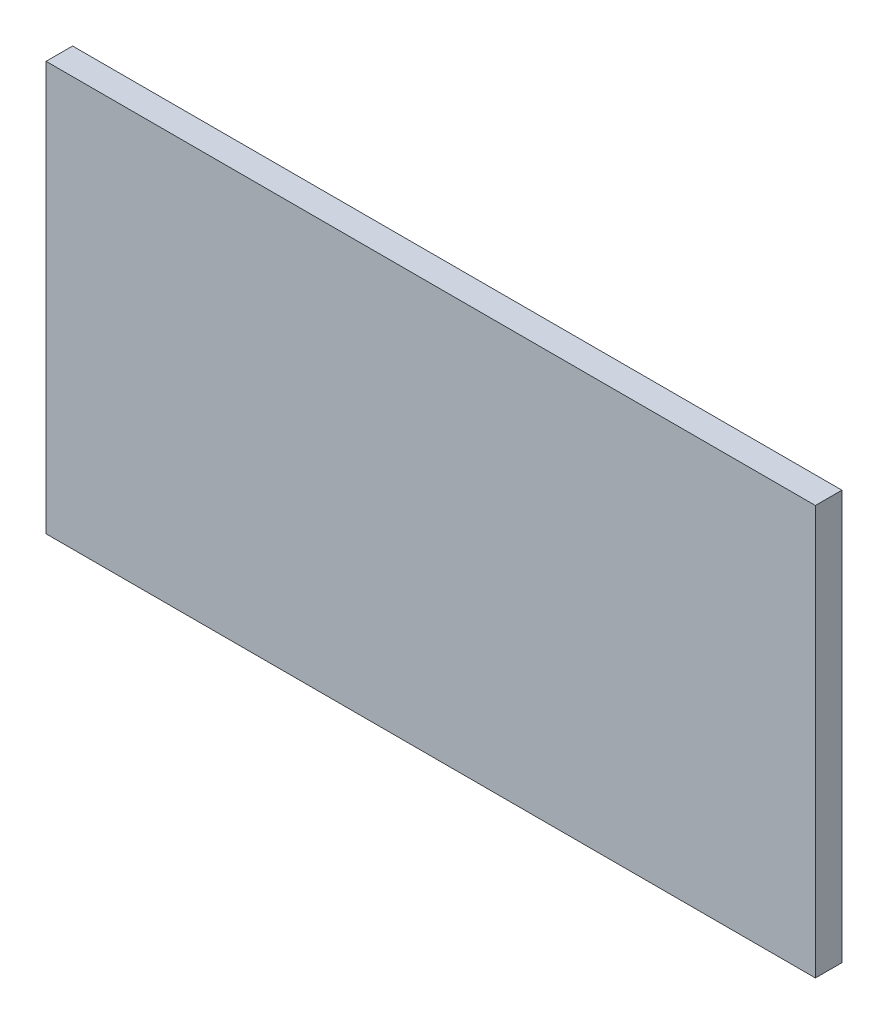
ISO-10303-21;
HEADER;
FILE_DESCRIPTION(('STEP AP214'),'2;1');
FILE_NAME('part.step','',(''),(''),'','','');
FILE_SCHEMA(('AUTOMOTIVE_DESIGN { 1 0 10303 214 1 1 1 1 }'));
ENDSEC;
DATA;
#1=APPLICATION_CONTEXT('core data for automotive mechanical design processes');
#2=APPLICATION_PROTOCOL_DEFINITION('international standard','automotive_design',2000,#1);
#3=PRODUCT_CONTEXT('',#1,'mechanical');
#4=PRODUCT('Part','Part','',(#3));
#5=PRODUCT_RELATED_PRODUCT_CATEGORY('part','',(#4));
#6=PRODUCT_DEFINITION_FORMATION('','',#4);
#7=PRODUCT_DEFINITION_CONTEXT('part definition',#1,'design');
#8=PRODUCT_DEFINITION('design','',#6,#7);
#9=PRODUCT_DEFINITION_SHAPE('','',#8);
#10=(LENGTH_UNIT() NAMED_UNIT(*) SI_UNIT(.MILLI.,.METRE.));
#11=(NAMED_UNIT(*) PLANE_ANGLE_UNIT() SI_UNIT($,.RADIAN.));
#12=(NAMED_UNIT(*) SI_UNIT($,.STERADIAN.) SOLID_ANGLE_UNIT());
#13=UNCERTAINTY_MEASURE_WITH_UNIT(LENGTH_MEASURE(1.E-05),#10,'distance_accuracy_value','');
#14=(GEOMETRIC_REPRESENTATION_CONTEXT(3) GLOBAL_UNCERTAINTY_ASSIGNED_CONTEXT((#13)) GLOBAL_UNIT_ASSIGNED_CONTEXT((#10,
#11,#12)) REPRESENTATION_CONTEXT('',''));
#15=CARTESIAN_POINT('',(0.,0.,0.));
#16=DIRECTION('',(0.,0.,1.));
#17=DIRECTION('',(1.,0.,0.));
#18=AXIS2_PLACEMENT_3D('',#15,#16,#17);
#19=CARTESIAN_POINT('',(167.13200378418,25.145999908447,0.41148));
#20=DIRECTION('',(0.,0.,1.));
#21=DIRECTION('',(1.,0.,0.));
#22=AXIS2_PLACEMENT_3D('',#19,#20,#21);
#23=PLANE('',#22);
#24=DIRECTION('',(1.,0.,0.));
#25=VECTOR('',#24,1.);
#26=CARTESIAN_POINT('',(167.13200378418,31.496000289917,0.41148));
#27=LINE('',#26,#25);
#28=CARTESIAN_POINT('',(167.13200378418,31.496000289917,0.41148));
#29=VERTEX_POINT('',#28);
#30=CARTESIAN_POINT('',(179.07000732421,31.496000289917,0.41148));
#31=VERTEX_POINT('',#30);
#32=EDGE_CURVE('E52',#29,#31,#27,.T.);
#33=ORIENTED_EDGE('',*,*,#32,.F.);
#34=DIRECTION('',(0.,1.,0.));
#35=VECTOR('',#34,1.);
#36=CARTESIAN_POINT('',(167.13200378418,25.145999908447,0.41148));
#37=LINE('',#36,#35);
#38=CARTESIAN_POINT('',(167.13200378418,25.145999908447,0.41148));
#39=VERTEX_POINT('',#38);
#40=EDGE_CURVE('E67',#39,#29,#37,.T.);
#41=ORIENTED_EDGE('',*,*,#40,.F.);
#42=DIRECTION('',(1.,0.,0.));
#43=VECTOR('',#42,1.);
#44=CARTESIAN_POINT('',(179.07000732421,25.145999908447,0.41148));
#45=LINE('',#44,#43);
#46=CARTESIAN_POINT('',(179.07000732421,25.145999908447,0.41148));
#47=VERTEX_POINT('',#46);
#48=EDGE_CURVE('E19',#47,#39,#45,.F.);
#49=ORIENTED_EDGE('',*,*,#48,.F.);
#50=DIRECTION('',(0.,1.,0.));
#51=VECTOR('',#50,1.);
#52=CARTESIAN_POINT('',(179.07000732421,31.496000289917,0.41148));
#53=LINE('',#52,#51);
#54=EDGE_CURVE('E57',#31,#47,#53,.F.);
#55=ORIENTED_EDGE('',*,*,#54,.F.);
#56=EDGE_LOOP('',(#33,#41,#49,#55));
#57=FACE_BOUND('',#56,.T.);
#58=ADVANCED_FACE('F16',(#57),#23,.T.);
#59=CARTESIAN_POINT('',(179.07000732421,25.145999908447,0.));
#60=DIRECTION('',(0.,-1.,0.));
#61=DIRECTION('',(0.,0.,-1.));
#62=AXIS2_PLACEMENT_3D('',#59,#60,#61);
#63=PLANE('',#62);
#64=DIRECTION('',(0.,0.,1.));
#65=VECTOR('',#64,1.);
#66=CARTESIAN_POINT('',(167.13200378418,25.145999908447,0.));
#67=LINE('',#66,#65);
#68=CARTESIAN_POINT('',(167.13200378418,25.145999908447,0.));
#69=VERTEX_POINT('',#68);
#70=EDGE_CURVE('E78',#69,#39,#67,.T.);
#71=ORIENTED_EDGE('',*,*,#70,.F.);
#72=DIRECTION('',(1.,0.,0.));
#73=VECTOR('',#72,1.);
#74=CARTESIAN_POINT('',(167.13200378418,25.145999908447,0.));
#75=LINE('',#74,#73);
#76=CARTESIAN_POINT('',(179.07000732421,25.145999908447,0.));
#77=VERTEX_POINT('',#76);
#78=EDGE_CURVE('E73',#69,#77,#75,.T.);
#79=ORIENTED_EDGE('',*,*,#78,.T.);
#80=DIRECTION('',(0.,0.,-1.));
#81=VECTOR('',#80,1.);
#82=CARTESIAN_POINT('',(179.07000732421,25.145999908447,0.));
#83=LINE('',#82,#81);
#84=EDGE_CURVE('E62',#47,#77,#83,.T.);
#85=ORIENTED_EDGE('',*,*,#84,.F.);
#86=ORIENTED_EDGE('',*,*,#48,.T.);
#87=EDGE_LOOP('',(#71,#79,#85,#86));
#88=FACE_BOUND('',#87,.T.);
#89=ADVANCED_FACE('F72',(#88),#63,.T.);
#90=CARTESIAN_POINT('',(179.07000732421,31.496000289917,0.));
#91=DIRECTION('',(1.,0.,0.));
#92=DIRECTION('',(0.,0.,-1.));
#93=AXIS2_PLACEMENT_3D('',#90,#91,#92);
#94=PLANE('',#93);
#95=ORIENTED_EDGE('',*,*,#84,.T.);
#96=DIRECTION('',(0.,1.,0.));
#97=VECTOR('',#96,1.);
#98=CARTESIAN_POINT('',(179.07000732421,25.145999908447,0.));
#99=LINE('',#98,#97);
#100=CARTESIAN_POINT('',(179.07000732421,31.496000289917,0.));
#101=VERTEX_POINT('',#100);
#102=EDGE_CURVE('E83',#77,#101,#99,.T.);
#103=ORIENTED_EDGE('',*,*,#102,.T.);
#104=DIRECTION('',(0.,0.,1.));
#105=VECTOR('',#104,1.);
#106=CARTESIAN_POINT('',(179.07000732421,31.496000289917,0.));
#107=LINE('',#106,#105);
#108=EDGE_CURVE('E64',#31,#101,#107,.F.);
#109=ORIENTED_EDGE('',*,*,#108,.F.);
#110=ORIENTED_EDGE('',*,*,#54,.T.);
#111=EDGE_LOOP('',(#95,#103,#109,#110));
#112=FACE_BOUND('',#111,.T.);
#113=ADVANCED_FACE('F59',(#112),#94,.T.);
#114=CARTESIAN_POINT('',(167.13200378418,31.496000289917,0.));
#115=DIRECTION('',(0.,1.,0.));
#116=DIRECTION('',(0.,0.,1.));
#117=AXIS2_PLACEMENT_3D('',#114,#115,#116);
#118=PLANE('',#117);
#119=ORIENTED_EDGE('',*,*,#108,.T.);
#120=DIRECTION('',(1.,0.,0.));
#121=VECTOR('',#120,1.);
#122=CARTESIAN_POINT('',(167.13200378418,31.496000289917,0.));
#123=LINE('',#122,#121);
#124=CARTESIAN_POINT('',(167.13200378418,31.496000289917,0.));
#125=VERTEX_POINT('',#124);
#126=EDGE_CURVE('E25',#101,#125,#123,.F.);
#127=ORIENTED_EDGE('',*,*,#126,.T.);
#128=DIRECTION('',(0.,0.,1.));
#129=VECTOR('',#128,1.);
#130=CARTESIAN_POINT('',(167.13200378418,31.496000289917,0.));
#131=LINE('',#130,#129);
#132=EDGE_CURVE('E33',#29,#125,#131,.F.);
#133=ORIENTED_EDGE('',*,*,#132,.F.);
#134=ORIENTED_EDGE('',*,*,#32,.T.);
#135=EDGE_LOOP('',(#119,#127,#133,#134));
#136=FACE_BOUND('',#135,.T.);
#137=ADVANCED_FACE('F87',(#136),#118,.T.);
#138=CARTESIAN_POINT('',(167.13200378418,25.145999908447,0.));
#139=DIRECTION('',(-1.,0.,0.));
#140=DIRECTION('',(0.,0.,1.));
#141=AXIS2_PLACEMENT_3D('',#138,#139,#140);
#142=PLANE('',#141);
#143=ORIENTED_EDGE('',*,*,#132,.T.);
#144=DIRECTION('',(0.,1.,0.));
#145=VECTOR('',#144,1.);
#146=CARTESIAN_POINT('',(167.13200378418,25.145999908447,0.));
#147=LINE('',#146,#145);
#148=EDGE_CURVE('E11',#125,#69,#147,.F.);
#149=ORIENTED_EDGE('',*,*,#148,.T.);
#150=ORIENTED_EDGE('',*,*,#70,.T.);
#151=ORIENTED_EDGE('',*,*,#40,.T.);
#152=EDGE_LOOP('',(#143,#149,#150,#151));
#153=FACE_BOUND('',#152,.T.);
#154=ADVANCED_FACE('F90',(#153),#142,.T.);
#155=CARTESIAN_POINT('',(167.13200378418,25.145999908447,0.));
#156=DIRECTION('',(0.,0.,1.));
#157=DIRECTION('',(1.,0.,0.));
#158=AXIS2_PLACEMENT_3D('',#155,#156,#157);
#159=PLANE('',#158);
#160=ORIENTED_EDGE('',*,*,#126,.F.);
#161=ORIENTED_EDGE('',*,*,#102,.F.);
#162=ORIENTED_EDGE('',*,*,#78,.F.);
#163=ORIENTED_EDGE('',*,*,#148,.F.);
#164=EDGE_LOOP('',(#160,#161,#162,#163));
#165=FACE_BOUND('',#164,.T.);
#166=ADVANCED_FACE('F89',(#165),#159,.F.);
#167=CLOSED_SHELL('',(#58,#89,#113,#137,#154,#166));
#168=MANIFOLD_SOLID_BREP('B1',#167);
#169=ADVANCED_BREP_SHAPE_REPRESENTATION('',(#18,#168),#14);
#170=SHAPE_DEFINITION_REPRESENTATION(#9,#169);
ENDSEC;
END-ISO-10303-21;
